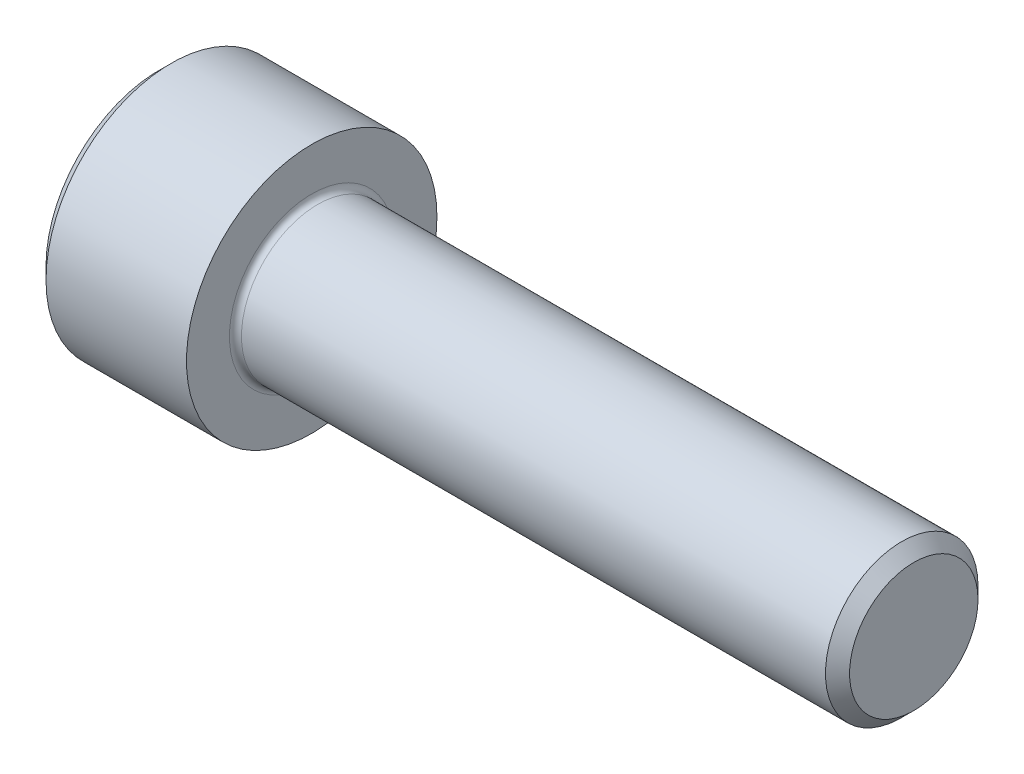
ISO-10303-21;
HEADER;
FILE_DESCRIPTION(('STEP AP214'),'2;1');
FILE_NAME('part.step','',(''),(''),'','','');
FILE_SCHEMA(('AUTOMOTIVE_DESIGN { 1 0 10303 214 1 1 1 1 }'));
ENDSEC;
DATA;
#1=APPLICATION_CONTEXT('core data for automotive mechanical design processes');
#2=APPLICATION_PROTOCOL_DEFINITION('international standard','automotive_design',2000,#1);
#3=PRODUCT_CONTEXT('',#1,'mechanical');
#4=PRODUCT('Part','Part','',(#3));
#5=PRODUCT_RELATED_PRODUCT_CATEGORY('part','',(#4));
#6=PRODUCT_DEFINITION_FORMATION('','',#4);
#7=PRODUCT_DEFINITION_CONTEXT('part definition',#1,'design');
#8=PRODUCT_DEFINITION('design','',#6,#7);
#9=PRODUCT_DEFINITION_SHAPE('','',#8);
#10=(LENGTH_UNIT() NAMED_UNIT(*) SI_UNIT(.MILLI.,.METRE.));
#11=(NAMED_UNIT(*) PLANE_ANGLE_UNIT() SI_UNIT($,.RADIAN.));
#12=(NAMED_UNIT(*) SI_UNIT($,.STERADIAN.) SOLID_ANGLE_UNIT());
#13=UNCERTAINTY_MEASURE_WITH_UNIT(LENGTH_MEASURE(1.E-05),#10,'distance_accuracy_value','');
#14=(GEOMETRIC_REPRESENTATION_CONTEXT(3) GLOBAL_UNCERTAINTY_ASSIGNED_CONTEXT((#13)) GLOBAL_UNIT_ASSIGNED_CONTEXT((#10,
#11,#12)) REPRESENTATION_CONTEXT('',''));
#15=CARTESIAN_POINT('',(0.,0.,0.));
#16=DIRECTION('',(0.,0.,1.));
#17=DIRECTION('',(1.,0.,0.));
#18=AXIS2_PLACEMENT_3D('',#15,#16,#17);
#19=CARTESIAN_POINT('',(0.,0.,0.));
#20=DIRECTION('',(-1.,0.,0.));
#21=DIRECTION('',(0.,0.,1.));
#22=AXIS2_PLACEMENT_3D('',#19,#20,#21);
#23=PLANE('',#22);
#24=CARTESIAN_POINT('',(0.,0.,0.));
#25=DIRECTION('',(-1.,0.,0.));
#26=DIRECTION('',(0.,0.,1.));
#27=AXIS2_PLACEMENT_3D('',#24,#25,#26);
#28=CIRCLE('',#27,3.58139999999999);
#29=CARTESIAN_POINT('',(0.,0.,3.58139999999999));
#30=VERTEX_POINT('',#29);
#31=EDGE_CURVE('E186',#30,#30,#28,.T.);
#32=ORIENTED_EDGE('',*,*,#31,.T.);
#33=EDGE_LOOP('',(#32));
#34=FACE_BOUND('',#33,.T.);
#35=CARTESIAN_POINT('',(0.,0.,0.));
#36=DIRECTION('',(1.,0.,0.));
#37=DIRECTION('',(0.,0.,-1.));
#38=AXIS2_PLACEMENT_3D('',#35,#36,#37);
#39=CIRCLE('',#38,2.29135888084633);
#40=CARTESIAN_POINT('',(0.,1.984375,1.14567944042316));
#41=VERTEX_POINT('',#40);
#42=CARTESIAN_POINT('',(0.,0.,2.29135888084633));
#43=VERTEX_POINT('',#42);
#44=EDGE_CURVE('E105',#41,#43,#39,.T.);
#45=ORIENTED_EDGE('',*,*,#44,.T.);
#46=CARTESIAN_POINT('',(0.,-1.984375,1.14567944042316));
#47=VERTEX_POINT('',#46);
#48=EDGE_CURVE('E133',#43,#47,#39,.T.);
#49=ORIENTED_EDGE('',*,*,#48,.T.);
#50=CARTESIAN_POINT('',(0.,-1.984375,-1.14567944042316));
#51=VERTEX_POINT('',#50);
#52=EDGE_CURVE('E132',#47,#51,#39,.T.);
#53=ORIENTED_EDGE('',*,*,#52,.T.);
#54=CARTESIAN_POINT('',(0.,0.,-2.29135888084633));
#55=VERTEX_POINT('',#54);
#56=EDGE_CURVE('E131',#51,#55,#39,.T.);
#57=ORIENTED_EDGE('',*,*,#56,.T.);
#58=CARTESIAN_POINT('',(0.,1.984375,-1.14567944042317));
#59=VERTEX_POINT('',#58);
#60=EDGE_CURVE('E104',#55,#59,#39,.T.);
#61=ORIENTED_EDGE('',*,*,#60,.T.);
#62=EDGE_CURVE('E97',#59,#41,#39,.T.);
#63=ORIENTED_EDGE('',*,*,#62,.T.);
#64=EDGE_LOOP('',(#45,#49,#53,#57,#61,#63));
#65=FACE_BOUND('',#64,.T.);
#66=ADVANCED_FACE('F37',(#34,#65),#23,.T.);
#67=CARTESIAN_POINT('',(23.876,0.,0.));
#68=DIRECTION('',(1.,0.,0.));
#69=DIRECTION('',(0.,0.,-1.));
#70=AXIS2_PLACEMENT_3D('',#67,#68,#69);
#71=CYLINDRICAL_SURFACE('',#70,3.96239999999999);
#72=CARTESIAN_POINT('',(0.380999999999999,0.,0.));
#73=DIRECTION('',(-1.,0.,0.));
#74=DIRECTION('',(0.,0.,1.));
#75=AXIS2_PLACEMENT_3D('',#72,#73,#74);
#76=CIRCLE('',#75,3.96239999999999);
#77=CARTESIAN_POINT('',(0.381,0.,3.96239999999999));
#78=VERTEX_POINT('',#77);
#79=EDGE_CURVE('E183',#78,#78,#76,.F.);
#80=ORIENTED_EDGE('',*,*,#79,.T.);
#81=EDGE_LOOP('',(#80));
#82=FACE_BOUND('',#81,.T.);
#83=CARTESIAN_POINT('',(4.826,0.,0.));
#84=DIRECTION('',(1.,0.,0.));
#85=DIRECTION('',(0.,0.,-1.));
#86=AXIS2_PLACEMENT_3D('',#83,#84,#85);
#87=CIRCLE('',#86,3.96239999999999);
#88=CARTESIAN_POINT('',(4.826,0.,-3.96239999999999));
#89=VERTEX_POINT('',#88);
#90=EDGE_CURVE('E174',#89,#89,#87,.T.);
#91=ORIENTED_EDGE('',*,*,#90,.F.);
#92=EDGE_LOOP('',(#91));
#93=FACE_BOUND('',#92,.T.);
#94=ADVANCED_FACE('F221',(#82,#93),#71,.T.);
#95=CARTESIAN_POINT('',(4.826,0.,-3.96239999999999));
#96=DIRECTION('',(1.,0.,0.));
#97=DIRECTION('',(0.,0.,-1.));
#98=AXIS2_PLACEMENT_3D('',#95,#96,#97);
#99=PLANE('',#98);
#100=CARTESIAN_POINT('',(4.826,0.,0.));
#101=DIRECTION('',(1.,0.,0.));
#102=DIRECTION('',(0.,0.,-1.));
#103=AXIS2_PLACEMENT_3D('',#100,#101,#102);
#104=CIRCLE('',#103,2.6035);
#105=CARTESIAN_POINT('',(4.826,0.,-2.6035));
#106=VERTEX_POINT('',#105);
#107=EDGE_CURVE('E51',#106,#106,#104,.F.);
#108=ORIENTED_EDGE('',*,*,#107,.T.);
#109=EDGE_LOOP('',(#108));
#110=FACE_BOUND('',#109,.T.);
#111=ORIENTED_EDGE('',*,*,#90,.T.);
#112=EDGE_LOOP('',(#111));
#113=FACE_BOUND('',#112,.T.);
#114=ADVANCED_FACE('F194',(#110,#113),#99,.T.);
#115=CARTESIAN_POINT('',(23.876,0.,0.));
#116=DIRECTION('',(1.,0.,0.));
#117=DIRECTION('',(0.,0.,-1.));
#118=AXIS2_PLACEMENT_3D('',#115,#116,#117);
#119=CYLINDRICAL_SURFACE('',#118,2.413);
#120=CARTESIAN_POINT('',(5.0165,0.,0.));
#121=DIRECTION('',(1.,0.,0.));
#122=DIRECTION('',(0.,0.,-1.));
#123=AXIS2_PLACEMENT_3D('',#120,#121,#122);
#124=CIRCLE('',#123,2.413);
#125=CARTESIAN_POINT('',(5.0165,0.,-2.413));
#126=VERTEX_POINT('',#125);
#127=EDGE_CURVE('E189',#126,#126,#124,.T.);
#128=ORIENTED_EDGE('',*,*,#127,.T.);
#129=EDGE_LOOP('',(#128));
#130=FACE_BOUND('',#129,.T.);
#131=CARTESIAN_POINT('',(23.495,0.,0.));
#132=DIRECTION('',(1.,0.,0.));
#133=DIRECTION('',(0.,0.,-1.));
#134=AXIS2_PLACEMENT_3D('',#131,#132,#133);
#135=CIRCLE('',#134,2.413);
#136=CARTESIAN_POINT('',(23.495,0.,-2.413));
#137=VERTEX_POINT('',#136);
#138=EDGE_CURVE('E180',#137,#137,#135,.F.);
#139=ORIENTED_EDGE('',*,*,#138,.T.);
#140=EDGE_LOOP('',(#139));
#141=FACE_BOUND('',#140,.T.);
#142=ADVANCED_FACE('F202',(#130,#141),#119,.T.);
#143=CARTESIAN_POINT('',(23.876,0.,-2.413));
#144=DIRECTION('',(1.,0.,0.));
#145=DIRECTION('',(0.,0.,-1.));
#146=AXIS2_PLACEMENT_3D('',#143,#144,#145);
#147=PLANE('',#146);
#148=CARTESIAN_POINT('',(23.876,0.,0.));
#149=DIRECTION('',(1.,0.,0.));
#150=DIRECTION('',(0.,0.,-1.));
#151=AXIS2_PLACEMENT_3D('',#148,#149,#150);
#152=CIRCLE('',#151,2.032);
#153=CARTESIAN_POINT('',(23.876,0.,-2.032));
#154=VERTEX_POINT('',#153);
#155=EDGE_CURVE('E177',#154,#154,#152,.T.);
#156=ORIENTED_EDGE('',*,*,#155,.T.);
#157=EDGE_LOOP('',(#156));
#158=FACE_BOUND('',#157,.T.);
#159=ADVANCED_FACE('F205',(#158),#147,.T.);
#160=CARTESIAN_POINT('',(23.876,0.,0.));
#161=DIRECTION('',(-1.,0.,0.));
#162=DIRECTION('',(0.,0.,1.));
#163=AXIS2_PLACEMENT_3D('',#160,#161,#162);
#164=CONICAL_SURFACE('',#163,2.032,0.785398163397445);
#165=ORIENTED_EDGE('',*,*,#138,.F.);
#166=EDGE_LOOP('',(#165));
#167=FACE_BOUND('',#166,.T.);
#168=ORIENTED_EDGE('',*,*,#155,.F.);
#169=EDGE_LOOP('',(#168));
#170=FACE_BOUND('',#169,.T.);
#171=ADVANCED_FACE('F209',(#167,#170),#164,.T.);
#172=CARTESIAN_POINT('',(0.380999999999999,0.,0.));
#173=DIRECTION('',(1.,0.,0.));
#174=DIRECTION('',(0.,0.,-1.));
#175=AXIS2_PLACEMENT_3D('',#172,#173,#174);
#176=CONICAL_SURFACE('',#175,3.96239999999999,0.785398163397451);
#177=ORIENTED_EDGE('',*,*,#31,.F.);
#178=EDGE_LOOP('',(#177));
#179=FACE_BOUND('',#178,.T.);
#180=ORIENTED_EDGE('',*,*,#79,.F.);
#181=EDGE_LOOP('',(#180));
#182=FACE_BOUND('',#181,.T.);
#183=ADVANCED_FACE('F199',(#179,#182),#176,.T.);
#184=CARTESIAN_POINT('',(5.0165,0.,0.));
#185=DIRECTION('',(1.,0.,0.));
#186=DIRECTION('',(0.,0.,-1.));
#187=AXIS2_PLACEMENT_3D('',#184,#185,#186);
#188=TOROIDAL_SURFACE('',#187,2.6035,0.1905);
#189=ORIENTED_EDGE('',*,*,#107,.F.);
#190=EDGE_LOOP('',(#189));
#191=FACE_BOUND('',#190,.T.);
#192=ORIENTED_EDGE('',*,*,#127,.F.);
#193=EDGE_LOOP('',(#192));
#194=FACE_BOUND('',#193,.T.);
#195=ADVANCED_FACE('F39',(#191,#194),#188,.F.);
#196=CARTESIAN_POINT('',(0.,0.,0.));
#197=DIRECTION('',(-1.,0.,0.));
#198=DIRECTION('',(0.,0.,-1.));
#199=AXIS2_PLACEMENT_3D('',#196,#197,#198);
#200=CONICAL_SURFACE('',#199,2.29135888084633,0.78539816339745);
#201=CARTESIAN_POINT('',(-0.000115478781843349,-0.000199999999999133,-2.29147435090017));
#202=CARTESIAN_POINT('',(0.0392371477360845,0.0680159951668036,-2.25208982772757));
#203=CARTESIAN_POINT('',(0.0762786895538146,0.137372685106967,-2.21204672412052));
#204=CARTESIAN_POINT('',(0.144101141576676,0.278798800452188,-2.13039431835551));
#205=CARTESIAN_POINT('',(0.174844310908246,0.350881678736783,-2.08877724917394));
#206=CARTESIAN_POINT('',(0.227508111188786,0.496233397266004,-2.00485839535392));
#207=CARTESIAN_POINT('',(0.249561124120036,0.569465212486939,-1.96257798712287));
#208=CARTESIAN_POINT('',(0.283538507056124,0.717541182594706,-1.87708628592063));
#209=CARTESIAN_POINT('',(0.295488243908271,0.792380812753425,-1.83387760530244));
#210=CARTESIAN_POINT('',(0.306269900918093,0.921360414543816,-1.75941119748879));
#211=CARTESIAN_POINT('',(0.307866100940929,0.975333715772442,-1.72824969749539));
#212=CARTESIAN_POINT('',(0.305178161134707,1.0831921185198,-1.66597761963484));
#213=CARTESIAN_POINT('',(0.30089195965954,1.13707718248552,-1.63486706344893));
#214=CARTESIAN_POINT('',(0.286683126986481,1.2443385382486,-1.57293969082547));
#215=CARTESIAN_POINT('',(0.276754189547727,1.29771419276014,-1.54212324232506));
#216=CARTESIAN_POINT('',(0.251804915725461,1.4035425174089,-1.48102323060122));
#217=CARTESIAN_POINT('',(0.236784969610511,1.4559952579711,-1.45073962671789));
#218=CARTESIAN_POINT('',(0.19219214836433,1.59035733896365,-1.37316564308797));
#219=CARTESIAN_POINT('',(0.159257004061667,1.67143335715832,-1.32635638215845));
#220=CARTESIAN_POINT('',(0.103657558797803,1.79064830672984,-1.25752759893191));
#221=CARTESIAN_POINT('',(0.0841224079481371,1.829934924386,-1.23484545965257));
#222=CARTESIAN_POINT('',(0.0432712618805977,1.90778036186805,-1.18990137536713));
#223=CARTESIAN_POINT('',(0.0219563604316488,1.9463396111017,-1.16763918244233));
#224=CARTESIAN_POINT('',(-0.000115478781843323,1.984575,-1.14556397036933));
#225=B_SPLINE_CURVE_WITH_KNOTS('',3,(#201,#202,#203,#204,#205,#206,#207,#208,#209,#210,#211,
#212,#213,#214,#215,#216,#217,#218,#219,#220,#221,#222,#223,#224),.UNSPECIFIED.,.F.,.F.,(4,2,2,
2,2,2,2,2,2,2,2,4),(0.,0.264339630306626,0.530219665093694,0.79187641637146,1.05287424418109,
1.239639843932,1.42647091743852,1.61351120244035,1.8005371524754,2.09764209964316,
2.24579179873714,2.39385111134157),.UNSPECIFIED.);
#226=EDGE_CURVE('E11',#55,#59,#225,.T.);
#227=ORIENTED_EDGE('',*,*,#226,.T.);
#228=ORIENTED_EDGE('',*,*,#60,.F.);
#229=EDGE_LOOP('',(#227,#228));
#230=FACE_BOUND('',#229,.T.);
#231=ADVANCED_FACE('F109',(#230),#200,.F.);
#232=CARTESIAN_POINT('',(-0.734984078816569,1.984375,-2.28495242157823));
#233=CARTESIAN_POINT('',(-0.692986685550763,1.984375,-2.22931635455402));
#234=CARTESIAN_POINT('',(-0.651396054076337,1.984375,-2.17336876548389));
#235=CARTESIAN_POINT('',(-0.56920846147148,1.984375,-2.06072770258171));
#236=CARTESIAN_POINT('',(-0.528611752405043,1.984375,-2.00403404503435));
#237=CARTESIAN_POINT('',(-0.448303503174669,1.984375,-1.88936329173489));
#238=CARTESIAN_POINT('',(-0.408601258813308,1.984375,-1.83137965519348));
#239=CARTESIAN_POINT('',(-0.330685173401292,1.984375,-1.7144280213784));
#240=CARTESIAN_POINT('',(-0.292471227194369,1.984375,-1.65546009407228));
#241=CARTESIAN_POINT('',(-0.176252834013637,1.984375,-1.47005472306035));
#242=CARTESIAN_POINT('',(-0.101347886872382,1.984375,-1.34163909427884));
#243=CARTESIAN_POINT('',(0.0356697845602623,1.984375,-1.0784038470548));
#244=CARTESIAN_POINT('',(0.0978256335176251,1.984375,-0.943607781407425));
#245=CARTESIAN_POINT('',(0.173867421311381,1.984375,-0.741275100444882));
#246=CARTESIAN_POINT('',(0.195691938673995,1.984375,-0.676735408881096));
#247=CARTESIAN_POINT('',(0.234159536462205,1.984375,-0.546098118112762));
#248=CARTESIAN_POINT('',(0.250802259934451,1.984375,-0.480000411919956));
#249=CARTESIAN_POINT('',(0.277764619130277,1.984375,-0.347746170028532));
#250=CARTESIAN_POINT('',(0.288192590264108,1.984375,-0.281612071479123));
#251=CARTESIAN_POINT('',(0.302521852623404,1.984375,-0.14863662005235));
#252=CARTESIAN_POINT('',(0.306424265772614,1.984375,-0.0817953907393241));
#253=CARTESIAN_POINT('',(0.307412948667328,1.984375,0.0495156750890641));
#254=CARTESIAN_POINT('',(0.304740821124985,1.984375,0.113983775102991));
#255=CARTESIAN_POINT('',(0.293260789502485,1.984375,0.242367515846177));
#256=CARTESIAN_POINT('',(0.284452289360786,1.984375,0.306283102295919));
#257=CARTESIAN_POINT('',(0.261030978667103,1.984375,0.434181040262184));
#258=CARTESIAN_POINT('',(0.246319393767914,1.984375,0.498145026858309));
#259=CARTESIAN_POINT('',(0.211873818587874,1.984375,0.624675616953007));
#260=CARTESIAN_POINT('',(0.192140248550805,1.984375,0.687242336899688));
#261=CARTESIAN_POINT('',(0.12258776276924,1.984375,0.884225483826087));
#262=CARTESIAN_POINT('',(0.0648475887435036,1.984375,1.01583674256468));
#263=CARTESIAN_POINT('',(-0.0635303365887976,1.984375,1.27288659242652));
#264=CARTESIAN_POINT('',(-0.134214424919412,1.984375,1.3983008827048));
#265=CARTESIAN_POINT('',(-0.244516663813198,1.984375,1.57956687990221));
#266=CARTESIAN_POINT('',(-0.280969829475363,1.984375,1.63738271299424));
#267=CARTESIAN_POINT('',(-0.355415963291704,1.984375,1.75202215386202));
#268=CARTESIAN_POINT('',(-0.393409048078054,1.984375,1.80884568601362));
#269=CARTESIAN_POINT('',(-0.47033880889309,1.984375,1.92116923084255));
#270=CARTESIAN_POINT('',(-0.509265313038791,1.984375,1.97667624512253));
#271=CARTESIAN_POINT('',(-0.588147746121386,1.984375,2.08693170717166));
#272=CARTESIAN_POINT('',(-0.628103389024029,1.984375,2.14168035934793));
#273=CARTESIAN_POINT('',(-0.668480611285426,1.984375,2.19611149046622));
#274=B_SPLINE_CURVE_WITH_KNOTS('',3,(#232,#233,#234,#235,#236,#237,#238,#239,#240,#241,#242,
#243,#244,#245,#246,#247,#248,#249,#250,#251,#252,#253,#254,#255,#256,#257,#258,#259,#260,#261,
#262,#263,#264,#265,#266,#267,#268,#269,#270,#271,#272,#273),.UNSPECIFIED.,.F.,.F.,(4,2,2,2,2,2,
2,2,2,2,2,2,2,2,2,2,2,2,2,2,4),(0.,0.209126070008322,0.41830463735657,0.629103979977993,
0.839888401371186,1.28549951116127,1.72957750768351,1.93379389749972,2.13802435186698,
2.33858179514334,2.53910475350639,2.73236963400794,2.92565329006887,3.12231577097488,
3.31896180041345,3.74886295245172,4.18033428125363,4.3853601718029,4.59040161996383,
4.79377749165108,4.99709743524132),.UNSPECIFIED.);
#275=EDGE_CURVE('E100',#59,#41,#274,.T.);
#276=ORIENTED_EDGE('',*,*,#275,.T.);
#277=ORIENTED_EDGE('',*,*,#62,.F.);
#278=EDGE_LOOP('',(#276,#277));
#279=FACE_BOUND('',#278,.T.);
#280=ADVANCED_FACE('F98',(#279),#200,.F.);
#281=CARTESIAN_POINT('',(-0.000115478781842481,1.984575,1.14556397036933));
#282=CARTESIAN_POINT('',(0.0392371477360859,1.9163590048332,1.18494849354192));
#283=CARTESIAN_POINT('',(0.0762786895538162,1.84700231489303,1.22499159714897));
#284=CARTESIAN_POINT('',(0.144101141576678,1.70557619954781,1.30664400291398));
#285=CARTESIAN_POINT('',(0.174844310908248,1.63349332126322,1.34826107209555));
#286=CARTESIAN_POINT('',(0.227508111188788,1.488141602734,1.43217992591557));
#287=CARTESIAN_POINT('',(0.249561124120037,1.41490978751306,1.47446033414662));
#288=CARTESIAN_POINT('',(0.283538507056126,1.26683381740529,1.55995203534886));
#289=CARTESIAN_POINT('',(0.295488243908273,1.19199418724658,1.60316071596705));
#290=CARTESIAN_POINT('',(0.306269900918095,1.06301458545618,1.6776271237807));
#291=CARTESIAN_POINT('',(0.307866100940931,1.00904128422756,1.7087886237741));
#292=CARTESIAN_POINT('',(0.305178161134708,0.901182881480199,1.77106070163465));
#293=CARTESIAN_POINT('',(0.300891959659542,0.847297817514476,1.80217125782056));
#294=CARTESIAN_POINT('',(0.286683126986482,0.740036461751395,1.86409863044402));
#295=CARTESIAN_POINT('',(0.276754189547728,0.686660807239859,1.89491507894443));
#296=CARTESIAN_POINT('',(0.251804915725463,0.580832482591103,1.95601509066827));
#297=CARTESIAN_POINT('',(0.236784969610513,0.528379742028898,1.9862986945516));
#298=CARTESIAN_POINT('',(0.192192148364332,0.394017661036351,2.06387267818152));
#299=CARTESIAN_POINT('',(0.159257004061669,0.312941642841676,2.11068193911104));
#300=CARTESIAN_POINT('',(0.103657558797805,0.193726693270161,2.17951072233758));
#301=CARTESIAN_POINT('',(0.084122407948139,0.154440075613999,2.20219286161692));
#302=CARTESIAN_POINT('',(0.0432712618805999,0.0765946381319472,2.24713694590236));
#303=CARTESIAN_POINT('',(0.021956360431651,0.0380353888983015,2.26939913882716));
#304=CARTESIAN_POINT('',(-0.000115478781841574,-0.000199999999999582,2.29147435090016));
#305=B_SPLINE_CURVE_WITH_KNOTS('',3,(#281,#282,#283,#284,#285,#286,#287,#288,#289,#290,#291,
#292,#293,#294,#295,#296,#297,#298,#299,#300,#301,#302,#303,#304),.UNSPECIFIED.,.F.,.F.,(4,2,2,
2,2,2,2,2,2,2,2,4),(0.,0.264339630306627,0.530219665093695,0.791876416371461,1.05287424418109,
1.239639843932,1.42647091743852,1.61351120244035,1.8005371524754,2.09764209964316,
2.24579179873714,2.39385111134157),.UNSPECIFIED.);
#306=EDGE_CURVE('E122',#41,#43,#305,.T.);
#307=ORIENTED_EDGE('',*,*,#306,.T.);
#308=ORIENTED_EDGE('',*,*,#44,.F.);
#309=EDGE_LOOP('',(#307,#308));
#310=FACE_BOUND('',#309,.T.);
#311=ADVANCED_FACE('F138',(#310),#200,.F.);
#312=CARTESIAN_POINT('',(-0.000115478781841364,0.00020000000000026,2.29147435090016));
#313=CARTESIAN_POINT('',(0.0392371477360873,-0.068015995166802,2.25208982772757));
#314=CARTESIAN_POINT('',(0.0762786895538173,-0.137372685106965,2.21204672412052));
#315=CARTESIAN_POINT('',(0.144101141576679,-0.278798800452187,2.13039431835551));
#316=CARTESIAN_POINT('',(0.174844310908248,-0.350881678736783,2.08877724917394));
#317=CARTESIAN_POINT('',(0.227508111188788,-0.496233397266004,2.00485839535392));
#318=CARTESIAN_POINT('',(0.249561124120038,-0.569465212486938,1.96257798712286));
#319=CARTESIAN_POINT('',(0.283538507056126,-0.717541182594706,1.87708628592063));
#320=CARTESIAN_POINT('',(0.295488243908273,-0.792380812753424,1.83387760530244));
#321=CARTESIAN_POINT('',(0.306269900918096,-0.921360414543815,1.75941119748879));
#322=CARTESIAN_POINT('',(0.307866100940932,-0.975333715772442,1.72824969749539));
#323=CARTESIAN_POINT('',(0.305178161134709,-1.0831921185198,1.66597761963484));
#324=CARTESIAN_POINT('',(0.300891959659542,-1.13707718248552,1.63486706344893));
#325=CARTESIAN_POINT('',(0.286683126986483,-1.2443385382486,1.57293969082547));
#326=CARTESIAN_POINT('',(0.276754189547729,-1.29771419276014,1.54212324232506));
#327=CARTESIAN_POINT('',(0.251804915725464,-1.4035425174089,1.48102323060121));
#328=CARTESIAN_POINT('',(0.236784969610514,-1.4559952579711,1.45073962671789));
#329=CARTESIAN_POINT('',(0.192192148364332,-1.59035733896365,1.37316564308797));
#330=CARTESIAN_POINT('',(0.159257004061669,-1.67143335715832,1.32635638215845));
#331=CARTESIAN_POINT('',(0.103657558797805,-1.79064830672984,1.25752759893191));
#332=CARTESIAN_POINT('',(0.0841224079481389,-1.829934924386,1.23484545965257));
#333=CARTESIAN_POINT('',(0.0432712618805996,-1.90778036186805,1.18990137536712));
#334=CARTESIAN_POINT('',(0.0219563604316507,-1.9463396111017,1.16763918244233));
#335=CARTESIAN_POINT('',(-0.000115478781841591,-1.984575,1.14556397036932));
#336=B_SPLINE_CURVE_WITH_KNOTS('',3,(#312,#313,#314,#315,#316,#317,#318,#319,#320,#321,#322,
#323,#324,#325,#326,#327,#328,#329,#330,#331,#332,#333,#334,#335),.UNSPECIFIED.,.F.,.F.,(4,2,2,
2,2,2,2,2,2,2,2,4),(0.,0.264339630306626,0.530219665093694,0.79187641637146,1.05287424418109,
1.239639843932,1.42647091743852,1.61351120244035,1.8005371524754,2.09764209964316,
2.24579179873714,2.39385111134157),.UNSPECIFIED.);
#337=EDGE_CURVE('E139',#43,#47,#336,.T.);
#338=ORIENTED_EDGE('',*,*,#337,.T.);
#339=ORIENTED_EDGE('',*,*,#48,.F.);
#340=EDGE_LOOP('',(#338,#339));
#341=FACE_BOUND('',#340,.T.);
#342=ADVANCED_FACE('F143',(#341),#200,.F.);
#343=CARTESIAN_POINT('',(-0.734984079067576,-1.984375,-2.28495242191067));
#344=CARTESIAN_POINT('',(-0.692986685792103,-1.984375,-2.22931635487714));
#345=CARTESIAN_POINT('',(-0.651396054308024,-1.984375,-2.17336876579766));
#346=CARTESIAN_POINT('',(-0.569208461683917,-1.984375,-2.06072770287667));
#347=CARTESIAN_POINT('',(-0.528611752607883,-1.984375,-2.00403404531985));
#348=CARTESIAN_POINT('',(-0.448303503358247,-1.984375,-1.88936329200117));
#349=CARTESIAN_POINT('',(-0.408601258987223,-1.984375,-1.83137965544999));
#350=CARTESIAN_POINT('',(-0.330685173556041,-1.984375,-1.71442802161519));
#351=CARTESIAN_POINT('',(-0.292471227339612,-1.984375,-1.65546009429911));
#352=CARTESIAN_POINT('',(-0.176252834128707,-1.984375,-1.47005472325436));
#353=CARTESIAN_POINT('',(-0.101347886967269,-1.984375,-1.3416390944495));
#354=CARTESIAN_POINT('',(0.0356697845027915,-1.984375,-1.07840384717678));
#355=CARTESIAN_POINT('',(0.097825633477414,-1.984375,-0.943607781504099));
#356=CARTESIAN_POINT('',(0.173867421283981,-1.984375,-0.74127510052251));
#357=CARTESIAN_POINT('',(0.195691938646095,-1.984375,-0.676735408966699));
#358=CARTESIAN_POINT('',(0.234159536434919,-1.984375,-0.546098118214578));
#359=CARTESIAN_POINT('',(0.25080225990828,-1.984375,-0.480000412030008));
#360=CARTESIAN_POINT('',(0.277764619108201,-1.984375,-0.347746170154786));
#361=CARTESIAN_POINT('',(0.288192590244966,-1.984375,-0.281612071613337));
#362=CARTESIAN_POINT('',(0.302521852611929,-1.984375,-0.14863662020222));
#363=CARTESIAN_POINT('',(0.306424265765872,-1.984375,-0.0817953908968883));
#364=CARTESIAN_POINT('',(0.307412948671392,-1.984375,0.0495156749173031));
#365=CARTESIAN_POINT('',(0.304740821135034,-1.984375,0.113983774924708));
#366=CARTESIAN_POINT('',(0.293260789525433,-1.984375,0.242367515655502));
#367=CARTESIAN_POINT('',(0.284452289390649,-1.984375,0.306283102099375));
#368=CARTESIAN_POINT('',(0.261030978711461,-1.984375,0.434181040054053));
#369=CARTESIAN_POINT('',(0.246319393819895,-1.984375,0.498145026644478));
#370=CARTESIAN_POINT('',(0.211873818655269,-1.984375,0.624675616728325));
#371=CARTESIAN_POINT('',(0.192140248625992,-1.984375,0.687242336669857));
#372=CARTESIAN_POINT('',(0.122587762881155,-1.984375,0.88422548354621));
#373=CARTESIAN_POINT('',(0.0648475888892086,-1.984375,1.01583674224241));
#374=CARTESIAN_POINT('',(-0.0635303363717901,-1.984375,1.27288659202273));
#375=CARTESIAN_POINT('',(-0.134214424664866,-1.984375,1.3983008822619));
#376=CARTESIAN_POINT('',(-0.244516663503638,-1.984375,1.57956687940503));
#377=CARTESIAN_POINT('',(-0.280969829148884,-1.984375,1.63738271248117));
#378=CARTESIAN_POINT('',(-0.35541596293131,-1.984375,1.75202215331741));
#379=CARTESIAN_POINT('',(-0.393409047700665,-1.984375,1.80884568545336));
#380=CARTESIAN_POINT('',(-0.470338808481904,-1.984375,1.92116923025136));
#381=CARTESIAN_POINT('',(-0.509265312610806,-1.984375,1.97667624451606));
#382=CARTESIAN_POINT('',(-0.588147745659823,-1.984375,2.08693170653472));
#383=CARTESIAN_POINT('',(-0.628103388545687,-1.984375,2.14168035869581));
#384=CARTESIAN_POINT('',(-0.668480610790327,-1.984375,2.19611148979895));
#385=B_SPLINE_CURVE_WITH_KNOTS('',3,(#343,#344,#345,#346,#347,#348,#349,#350,#351,#352,#353,
#354,#355,#356,#357,#358,#359,#360,#361,#362,#363,#364,#365,#366,#367,#368,#369,#370,#371,#372,
#373,#374,#375,#376,#377,#378,#379,#380,#381,#382,#383,#384),.UNSPECIFIED.,.F.,.F.,(4,2,2,2,2,2,
2,2,2,2,2,2,2,2,2,2,2,2,2,2,4),(0.,0.209126070048127,0.418304637436191,0.629103980098179,
0.839888401531931,1.28549951141299,1.72957750802534,1.93379389781848,2.13802435216272,
2.33858179541699,2.53910475375796,2.7323696342393,2.92565329027999,3.12231577116422,
3.31896180058103,3.74886295246281,4.18033428110719,4.38536017158908,4.59040161968262,
4.7937774913034,4.99709743482717),.UNSPECIFIED.);
#386=EDGE_CURVE('E147',#47,#51,#385,.F.);
#387=ORIENTED_EDGE('',*,*,#386,.T.);
#388=ORIENTED_EDGE('',*,*,#52,.F.);
#389=EDGE_LOOP('',(#387,#388));
#390=FACE_BOUND('',#389,.T.);
#391=ADVANCED_FACE('F254',(#390),#200,.F.);
#392=CARTESIAN_POINT('',(-0.000115478781843349,-1.984575,-1.14556397036933));
#393=CARTESIAN_POINT('',(0.0392371477360848,-1.9163590048332,-1.18494849354192));
#394=CARTESIAN_POINT('',(0.0762786895538148,-1.84700231489303,-1.22499159714897));
#395=CARTESIAN_POINT('',(0.144101141576676,-1.70557619954781,-1.30664400291398));
#396=CARTESIAN_POINT('',(0.174844310908246,-1.63349332126322,-1.34826107209555));
#397=CARTESIAN_POINT('',(0.227508111188786,-1.488141602734,-1.43217992591557));
#398=CARTESIAN_POINT('',(0.249561124120036,-1.41490978751306,-1.47446033414663));
#399=CARTESIAN_POINT('',(0.283538507056124,-1.26683381740529,-1.55995203534886));
#400=CARTESIAN_POINT('',(0.295488243908272,-1.19199418724658,-1.60316071596705));
#401=CARTESIAN_POINT('',(0.306269900918094,-1.06301458545618,-1.6776271237807));
#402=CARTESIAN_POINT('',(0.30786610094093,-1.00904128422756,-1.7087886237741));
#403=CARTESIAN_POINT('',(0.305178161134707,-0.9011828814802,-1.77106070163465));
#404=CARTESIAN_POINT('',(0.300891959659541,-0.847297817514477,-1.80217125782056));
#405=CARTESIAN_POINT('',(0.286683126986481,-0.740036461751396,-1.86409863044402));
#406=CARTESIAN_POINT('',(0.276754189547727,-0.68666080723986,-1.89491507894443));
#407=CARTESIAN_POINT('',(0.251804915725462,-0.580832482591103,-1.95601509066828));
#408=CARTESIAN_POINT('',(0.236784969610512,-0.528379742028898,-1.9862986945516));
#409=CARTESIAN_POINT('',(0.19219214836433,-0.394017661036351,-2.06387267818152));
#410=CARTESIAN_POINT('',(0.159257004061668,-0.312941642841675,-2.11068193911104));
#411=CARTESIAN_POINT('',(0.103657558797804,-0.19372669327016,-2.17951072233758));
#412=CARTESIAN_POINT('',(0.0841224079481378,-0.154440075613998,-2.20219286161692));
#413=CARTESIAN_POINT('',(0.0432712618805984,-0.0765946381319464,-2.24713694590237));
#414=CARTESIAN_POINT('',(0.0219563604316494,-0.0380353888983007,-2.26939913882716));
#415=CARTESIAN_POINT('',(-0.000115478781842991,0.000200000000000542,-2.29147435090017));
#416=B_SPLINE_CURVE_WITH_KNOTS('',3,(#392,#393,#394,#395,#396,#397,#398,#399,#400,#401,#402,
#403,#404,#405,#406,#407,#408,#409,#410,#411,#412,#413,#414,#415),.UNSPECIFIED.,.F.,.F.,(4,2,2,
2,2,2,2,2,2,2,2,4),(0.,0.264339630306627,0.530219665093694,0.79187641637146,1.05287424418109,
1.239639843932,1.42647091743852,1.61351120244035,1.8005371524754,2.09764209964316,
2.24579179873714,2.39385111134157),.UNSPECIFIED.);
#417=EDGE_CURVE('E57',#51,#55,#416,.T.);
#418=ORIENTED_EDGE('',*,*,#417,.T.);
#419=ORIENTED_EDGE('',*,*,#56,.F.);
#420=EDGE_LOOP('',(#418,#419));
#421=FACE_BOUND('',#420,.T.);
#422=ADVANCED_FACE('F232',(#421),#200,.F.);
#423=CARTESIAN_POINT('',(3.21733333333333,0.,0.));
#424=DIRECTION('',(1.,0.,0.));
#425=DIRECTION('',(0.,0.,-1.));
#426=AXIS2_PLACEMENT_3D('',#423,#424,#425);
#427=PLANE('',#426);
#428=DIRECTION('',(0.,-0.866025403784439,-0.5));
#429=VECTOR('',#428,1.);
#430=CARTESIAN_POINT('',(3.21733333333333,1.984375,-1.14567944042316));
#431=LINE('',#430,#429);
#432=CARTESIAN_POINT('',(3.21733333333333,1.984375,-1.14567944042316));
#433=VERTEX_POINT('',#432);
#434=CARTESIAN_POINT('',(3.21733333333333,0.,-2.29135888084633));
#435=VERTEX_POINT('',#434);
#436=EDGE_CURVE('E126',#433,#435,#431,.T.);
#437=ORIENTED_EDGE('',*,*,#436,.T.);
#438=DIRECTION('',(0.,-0.866025403784439,0.5));
#439=VECTOR('',#438,1.);
#440=CARTESIAN_POINT('',(3.21733333333333,0.,-2.29135888084633));
#441=LINE('',#440,#439);
#442=CARTESIAN_POINT('',(3.21733333333333,-1.984375,-1.14567944042317));
#443=VERTEX_POINT('',#442);
#444=EDGE_CURVE('E171',#435,#443,#441,.T.);
#445=ORIENTED_EDGE('',*,*,#444,.T.);
#446=DIRECTION('',(0.,0.,1.));
#447=VECTOR('',#446,1.);
#448=CARTESIAN_POINT('',(3.21733333333333,-1.984375,-1.14567944042316));
#449=LINE('',#448,#447);
#450=CARTESIAN_POINT('',(3.21733333333333,-1.984375,1.14567944042316));
#451=VERTEX_POINT('',#450);
#452=EDGE_CURVE('E163',#443,#451,#449,.T.);
#453=ORIENTED_EDGE('',*,*,#452,.T.);
#454=DIRECTION('',(0.,0.866025403784439,0.5));
#455=VECTOR('',#454,1.);
#456=CARTESIAN_POINT('',(3.21733333333333,-1.984375,1.14567944042316));
#457=LINE('',#456,#455);
#458=CARTESIAN_POINT('',(3.21733333333333,0.,2.29135888084633));
#459=VERTEX_POINT('',#458);
#460=EDGE_CURVE('E162',#451,#459,#457,.T.);
#461=ORIENTED_EDGE('',*,*,#460,.T.);
#462=DIRECTION('',(0.,0.866025403784439,-0.5));
#463=VECTOR('',#462,1.);
#464=CARTESIAN_POINT('',(3.21733333333333,0.,2.29135888084633));
#465=LINE('',#464,#463);
#466=CARTESIAN_POINT('',(3.21733333333333,1.984375,1.14567944042316));
#467=VERTEX_POINT('',#466);
#468=EDGE_CURVE('E437',#459,#467,#465,.T.);
#469=ORIENTED_EDGE('',*,*,#468,.T.);
#470=DIRECTION('',(0.,0.,-1.));
#471=VECTOR('',#470,1.);
#472=CARTESIAN_POINT('',(3.21733333333333,1.984375,1.14567944042316));
#473=LINE('',#472,#471);
#474=EDGE_CURVE('E127',#467,#433,#473,.T.);
#475=ORIENTED_EDGE('',*,*,#474,.T.);
#476=EDGE_LOOP('',(#437,#445,#453,#461,#469,#475));
#477=FACE_BOUND('',#476,.T.);
#478=ADVANCED_FACE('F229',(#477),#427,.F.);
#479=CARTESIAN_POINT('',(9.27969909645199,1.984375,-1.14567944042316));
#480=DIRECTION('',(0.,0.5,-0.866025403784439));
#481=DIRECTION('',(0.,0.866025403784439,0.5));
#482=AXIS2_PLACEMENT_3D('',#479,#480,#481);
#483=PLANE('',#482);
#484=ORIENTED_EDGE('',*,*,#226,.F.);
#485=DIRECTION('',(-1.,0.,0.));
#486=VECTOR('',#485,1.);
#487=CARTESIAN_POINT('',(9.27969909645199,0.,-2.29135888084633));
#488=LINE('',#487,#486);
#489=EDGE_CURVE('E172',#435,#55,#488,.T.);
#490=ORIENTED_EDGE('',*,*,#489,.F.);
#491=ORIENTED_EDGE('',*,*,#436,.F.);
#492=DIRECTION('',(-1.,0.,0.));
#493=VECTOR('',#492,1.);
#494=CARTESIAN_POINT('',(9.27969909645199,1.984375,-1.14567944042316));
#495=LINE('',#494,#493);
#496=EDGE_CURVE('E118',#433,#59,#495,.T.);
#497=ORIENTED_EDGE('',*,*,#496,.T.);
#498=EDGE_LOOP('',(#484,#490,#491,#497));
#499=FACE_BOUND('',#498,.T.);
#500=ADVANCED_FACE('F124',(#499),#483,.F.);
#501=CARTESIAN_POINT('',(9.27969909645199,1.984375,1.14567944042316));
#502=DIRECTION('',(0.,1.,0.));
#503=DIRECTION('',(0.,0.,1.));
#504=AXIS2_PLACEMENT_3D('',#501,#502,#503);
#505=PLANE('',#504);
#506=ORIENTED_EDGE('',*,*,#275,.F.);
#507=ORIENTED_EDGE('',*,*,#496,.F.);
#508=ORIENTED_EDGE('',*,*,#474,.F.);
#509=DIRECTION('',(-1.,0.,0.));
#510=VECTOR('',#509,1.);
#511=CARTESIAN_POINT('',(9.27969909645199,1.984375,1.14567944042316));
#512=LINE('',#511,#510);
#513=EDGE_CURVE('E121',#467,#41,#512,.T.);
#514=ORIENTED_EDGE('',*,*,#513,.T.);
#515=EDGE_LOOP('',(#506,#507,#508,#514));
#516=FACE_BOUND('',#515,.T.);
#517=ADVANCED_FACE('F117',(#516),#505,.F.);
#518=CARTESIAN_POINT('',(9.27969909645199,0.,2.29135888084633));
#519=DIRECTION('',(0.,0.5,0.866025403784439));
#520=DIRECTION('',(0.,-0.866025403784439,0.5));
#521=AXIS2_PLACEMENT_3D('',#518,#519,#520);
#522=PLANE('',#521);
#523=ORIENTED_EDGE('',*,*,#306,.F.);
#524=ORIENTED_EDGE('',*,*,#513,.F.);
#525=ORIENTED_EDGE('',*,*,#468,.F.);
#526=DIRECTION('',(-1.,0.,0.));
#527=VECTOR('',#526,1.);
#528=CARTESIAN_POINT('',(9.27969909645199,0.,2.29135888084633));
#529=LINE('',#528,#527);
#530=EDGE_CURVE('E65',#459,#43,#529,.T.);
#531=ORIENTED_EDGE('',*,*,#530,.T.);
#532=EDGE_LOOP('',(#523,#524,#525,#531));
#533=FACE_BOUND('',#532,.T.);
#534=ADVANCED_FACE('F277',(#533),#522,.F.);
#535=CARTESIAN_POINT('',(9.27969909645199,-1.984375,1.14567944042316));
#536=DIRECTION('',(0.,-0.5,0.866025403784439));
#537=DIRECTION('',(0.,-0.866025403784439,-0.5));
#538=AXIS2_PLACEMENT_3D('',#535,#536,#537);
#539=PLANE('',#538);
#540=ORIENTED_EDGE('',*,*,#337,.F.);
#541=ORIENTED_EDGE('',*,*,#530,.F.);
#542=ORIENTED_EDGE('',*,*,#460,.F.);
#543=DIRECTION('',(-1.,0.,0.));
#544=VECTOR('',#543,1.);
#545=CARTESIAN_POINT('',(9.27969909645199,-1.984375,1.14567944042316));
#546=LINE('',#545,#544);
#547=EDGE_CURVE('E154',#451,#47,#546,.T.);
#548=ORIENTED_EDGE('',*,*,#547,.T.);
#549=EDGE_LOOP('',(#540,#541,#542,#548));
#550=FACE_BOUND('',#549,.T.);
#551=ADVANCED_FACE('F160',(#550),#539,.F.);
#552=CARTESIAN_POINT('',(9.27969909645199,-1.984375,-1.14567944042316));
#553=DIRECTION('',(0.,-1.,0.));
#554=DIRECTION('',(0.,0.,-1.));
#555=AXIS2_PLACEMENT_3D('',#552,#553,#554);
#556=PLANE('',#555);
#557=ORIENTED_EDGE('',*,*,#386,.F.);
#558=ORIENTED_EDGE('',*,*,#547,.F.);
#559=ORIENTED_EDGE('',*,*,#452,.F.);
#560=DIRECTION('',(-1.,0.,0.));
#561=VECTOR('',#560,1.);
#562=CARTESIAN_POINT('',(9.27969909645199,-1.984375,-1.14567944042316));
#563=LINE('',#562,#561);
#564=EDGE_CURVE('E157',#443,#51,#563,.T.);
#565=ORIENTED_EDGE('',*,*,#564,.T.);
#566=EDGE_LOOP('',(#557,#558,#559,#565));
#567=FACE_BOUND('',#566,.T.);
#568=ADVANCED_FACE('F153',(#567),#556,.F.);
#569=CARTESIAN_POINT('',(9.27969909645199,0.,-2.29135888084633));
#570=DIRECTION('',(0.,-0.5,-0.866025403784439));
#571=DIRECTION('',(0.,0.866025403784439,-0.5));
#572=AXIS2_PLACEMENT_3D('',#569,#570,#571);
#573=PLANE('',#572);
#574=ORIENTED_EDGE('',*,*,#417,.F.);
#575=ORIENTED_EDGE('',*,*,#564,.F.);
#576=ORIENTED_EDGE('',*,*,#444,.F.);
#577=ORIENTED_EDGE('',*,*,#489,.T.);
#578=EDGE_LOOP('',(#574,#575,#576,#577));
#579=FACE_BOUND('',#578,.T.);
#580=ADVANCED_FACE('F234',(#579),#573,.F.);
#581=CLOSED_SHELL('',(#66,#94,#114,#142,#159,#171,#183,#195,#231,#280,#311,#342,#391,#422,#478,
#500,#517,#534,#551,#568,#580));
#582=MANIFOLD_SOLID_BREP('B2',#581);
#583=ADVANCED_BREP_SHAPE_REPRESENTATION('',(#18,#582),#14);
#584=SHAPE_DEFINITION_REPRESENTATION(#9,#583);
ENDSEC;
END-ISO-10303-21;
